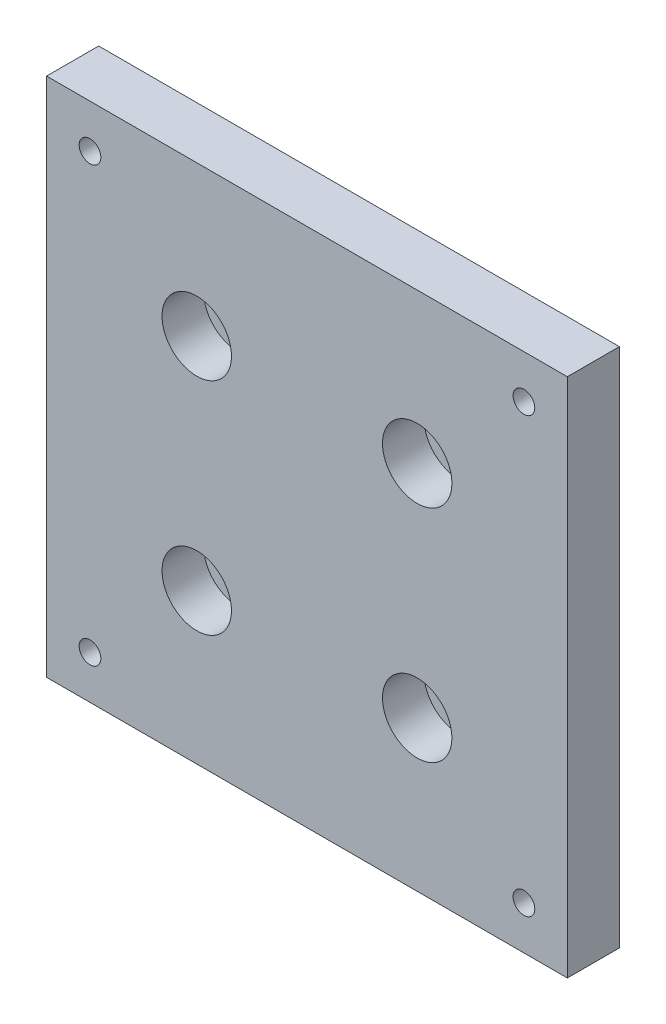
ISO-10303-21;
HEADER;
FILE_DESCRIPTION(('STEP AP214'),'2;1');
FILE_NAME('part.step','',(''),(''),'','','');
FILE_SCHEMA(('AUTOMOTIVE_DESIGN { 1 0 10303 214 1 1 1 1 }'));
ENDSEC;
DATA;
#1=APPLICATION_CONTEXT('core data for automotive mechanical design processes');
#2=APPLICATION_PROTOCOL_DEFINITION('international standard','automotive_design',2000,#1);
#3=PRODUCT_CONTEXT('',#1,'mechanical');
#4=PRODUCT('Part','Part','',(#3));
#5=PRODUCT_RELATED_PRODUCT_CATEGORY('part','',(#4));
#6=PRODUCT_DEFINITION_FORMATION('','',#4);
#7=PRODUCT_DEFINITION_CONTEXT('part definition',#1,'design');
#8=PRODUCT_DEFINITION('design','',#6,#7);
#9=PRODUCT_DEFINITION_SHAPE('','',#8);
#10=(LENGTH_UNIT() NAMED_UNIT(*) SI_UNIT(.MILLI.,.METRE.));
#11=(NAMED_UNIT(*) PLANE_ANGLE_UNIT() SI_UNIT($,.RADIAN.));
#12=(NAMED_UNIT(*) SI_UNIT($,.STERADIAN.) SOLID_ANGLE_UNIT());
#13=UNCERTAINTY_MEASURE_WITH_UNIT(LENGTH_MEASURE(1.E-05),#10,'distance_accuracy_value','');
#14=(GEOMETRIC_REPRESENTATION_CONTEXT(3) GLOBAL_UNCERTAINTY_ASSIGNED_CONTEXT((#13)) GLOBAL_UNIT_ASSIGNED_CONTEXT((#10,
#11,#12)) REPRESENTATION_CONTEXT('',''));
#15=CARTESIAN_POINT('',(0.,0.,0.));
#16=DIRECTION('',(0.,0.,1.));
#17=DIRECTION('',(1.,0.,0.));
#18=AXIS2_PLACEMENT_3D('',#15,#16,#17);
#19=CARTESIAN_POINT('',(30.,30.,6.));
#20=DIRECTION('',(-1.,0.,0.));
#21=DIRECTION('',(0.,0.,1.));
#22=AXIS2_PLACEMENT_3D('',#19,#20,#21);
#23=PLANE('',#22);
#24=DIRECTION('',(0.,1.,0.));
#25=VECTOR('',#24,1.);
#26=CARTESIAN_POINT('',(30.,30.,0.));
#27=LINE('',#26,#25);
#28=CARTESIAN_POINT('',(30.,-30.,0.));
#29=VERTEX_POINT('',#28);
#30=CARTESIAN_POINT('',(30.,30.,0.));
#31=VERTEX_POINT('',#30);
#32=EDGE_CURVE('E109',#29,#31,#27,.T.);
#33=ORIENTED_EDGE('',*,*,#32,.T.);
#34=DIRECTION('',(0.,0.,-1.));
#35=VECTOR('',#34,1.);
#36=CARTESIAN_POINT('',(30.,30.,6.));
#37=LINE('',#36,#35);
#38=CARTESIAN_POINT('',(30.,30.,6.));
#39=VERTEX_POINT('',#38);
#40=EDGE_CURVE('E11',#39,#31,#37,.T.);
#41=ORIENTED_EDGE('',*,*,#40,.F.);
#42=DIRECTION('',(0.,1.,0.));
#43=VECTOR('',#42,1.);
#44=CARTESIAN_POINT('',(30.,30.,6.));
#45=LINE('',#44,#43);
#46=CARTESIAN_POINT('',(30.,-30.,6.));
#47=VERTEX_POINT('',#46);
#48=EDGE_CURVE('E93',#47,#39,#45,.T.);
#49=ORIENTED_EDGE('',*,*,#48,.F.);
#50=DIRECTION('',(0.,0.,-1.));
#51=VECTOR('',#50,1.);
#52=CARTESIAN_POINT('',(30.,-30.,6.));
#53=LINE('',#52,#51);
#54=EDGE_CURVE('E105',#47,#29,#53,.T.);
#55=ORIENTED_EDGE('',*,*,#54,.T.);
#56=EDGE_LOOP('',(#33,#41,#49,#55));
#57=FACE_BOUND('',#56,.T.);
#58=ADVANCED_FACE('F41',(#57),#23,.F.);
#59=CARTESIAN_POINT('',(-30.,30.,6.));
#60=DIRECTION('',(0.,-1.,0.));
#61=DIRECTION('',(0.,0.,-1.));
#62=AXIS2_PLACEMENT_3D('',#59,#60,#61);
#63=PLANE('',#62);
#64=DIRECTION('',(-1.,0.,0.));
#65=VECTOR('',#64,1.);
#66=CARTESIAN_POINT('',(-30.,30.,0.));
#67=LINE('',#66,#65);
#68=CARTESIAN_POINT('',(-30.,30.,0.));
#69=VERTEX_POINT('',#68);
#70=EDGE_CURVE('E98',#31,#69,#67,.T.);
#71=ORIENTED_EDGE('',*,*,#70,.T.);
#72=DIRECTION('',(0.,0.,-1.));
#73=VECTOR('',#72,1.);
#74=CARTESIAN_POINT('',(-30.,30.,6.));
#75=LINE('',#74,#73);
#76=CARTESIAN_POINT('',(-30.,30.,6.));
#77=VERTEX_POINT('',#76);
#78=EDGE_CURVE('E50',#77,#69,#75,.T.);
#79=ORIENTED_EDGE('',*,*,#78,.F.);
#80=DIRECTION('',(-1.,0.,0.));
#81=VECTOR('',#80,1.);
#82=CARTESIAN_POINT('',(-30.,30.,6.));
#83=LINE('',#82,#81);
#84=EDGE_CURVE('E88',#39,#77,#83,.T.);
#85=ORIENTED_EDGE('',*,*,#84,.F.);
#86=ORIENTED_EDGE('',*,*,#40,.T.);
#87=EDGE_LOOP('',(#71,#79,#85,#86));
#88=FACE_BOUND('',#87,.T.);
#89=ADVANCED_FACE('F97',(#88),#63,.F.);
#90=CARTESIAN_POINT('',(-30.,30.,6.));
#91=DIRECTION('',(1.,0.,0.));
#92=DIRECTION('',(0.,1.,0.));
#93=AXIS2_PLACEMENT_3D('',#90,#91,#92);
#94=PLANE('',#93);
#95=DIRECTION('',(0.,-1.,0.));
#96=VECTOR('',#95,1.);
#97=CARTESIAN_POINT('',(-30.,30.,0.));
#98=LINE('',#97,#96);
#99=CARTESIAN_POINT('',(-30.,-30.,0.));
#100=VERTEX_POINT('',#99);
#101=EDGE_CURVE('E75',#69,#100,#98,.T.);
#102=ORIENTED_EDGE('',*,*,#101,.T.);
#103=DIRECTION('',(0.,0.,-1.));
#104=VECTOR('',#103,1.);
#105=CARTESIAN_POINT('',(-30.,-30.,6.));
#106=LINE('',#105,#104);
#107=CARTESIAN_POINT('',(-30.,-30.,6.));
#108=VERTEX_POINT('',#107);
#109=EDGE_CURVE('E100',#108,#100,#106,.T.);
#110=ORIENTED_EDGE('',*,*,#109,.F.);
#111=DIRECTION('',(0.,-1.,0.));
#112=VECTOR('',#111,1.);
#113=CARTESIAN_POINT('',(-30.,30.,6.));
#114=LINE('',#113,#112);
#115=EDGE_CURVE('E91',#77,#108,#114,.T.);
#116=ORIENTED_EDGE('',*,*,#115,.F.);
#117=ORIENTED_EDGE('',*,*,#78,.T.);
#118=EDGE_LOOP('',(#102,#110,#116,#117));
#119=FACE_BOUND('',#118,.T.);
#120=ADVANCED_FACE('F101',(#119),#94,.F.);
#121=CARTESIAN_POINT('',(-30.,-30.,6.));
#122=DIRECTION('',(0.,1.,0.));
#123=DIRECTION('',(0.,0.,1.));
#124=AXIS2_PLACEMENT_3D('',#121,#122,#123);
#125=PLANE('',#124);
#126=DIRECTION('',(1.,0.,0.));
#127=VECTOR('',#126,1.);
#128=CARTESIAN_POINT('',(-30.,-30.,0.));
#129=LINE('',#128,#127);
#130=EDGE_CURVE('E81',#100,#29,#129,.T.);
#131=ORIENTED_EDGE('',*,*,#130,.T.);
#132=ORIENTED_EDGE('',*,*,#54,.F.);
#133=DIRECTION('',(1.,0.,0.));
#134=VECTOR('',#133,1.);
#135=CARTESIAN_POINT('',(-30.,-30.,6.));
#136=LINE('',#135,#134);
#137=EDGE_CURVE('E58',#108,#47,#136,.T.);
#138=ORIENTED_EDGE('',*,*,#137,.F.);
#139=ORIENTED_EDGE('',*,*,#109,.T.);
#140=EDGE_LOOP('',(#131,#132,#138,#139));
#141=FACE_BOUND('',#140,.T.);
#142=ADVANCED_FACE('F123',(#141),#125,.F.);
#143=CARTESIAN_POINT('',(0.,0.,6.));
#144=DIRECTION('',(0.,0.,1.));
#145=DIRECTION('',(1.,0.,0.));
#146=AXIS2_PLACEMENT_3D('',#143,#144,#145);
#147=PLANE('',#146);
#148=CARTESIAN_POINT('',(-12.7,12.7,6.));
#149=DIRECTION('',(0.,0.,1.));
#150=DIRECTION('',(1.,0.,0.));
#151=AXIS2_PLACEMENT_3D('',#148,#149,#150);
#152=CIRCLE('',#151,4.00000000000001);
#153=CARTESIAN_POINT('',(-8.69999999999999,12.7,6.));
#154=VERTEX_POINT('',#153);
#155=EDGE_CURVE('E221',#154,#154,#152,.T.);
#156=ORIENTED_EDGE('',*,*,#155,.F.);
#157=EDGE_LOOP('',(#156));
#158=FACE_BOUND('',#157,.T.);
#159=CARTESIAN_POINT('',(12.7,12.7,6.));
#160=DIRECTION('',(0.,0.,1.));
#161=DIRECTION('',(1.,0.,0.));
#162=AXIS2_PLACEMENT_3D('',#159,#160,#161);
#163=CIRCLE('',#162,4.00000000000001);
#164=CARTESIAN_POINT('',(16.7,12.7,6.));
#165=VERTEX_POINT('',#164);
#166=EDGE_CURVE('E205',#165,#165,#163,.T.);
#167=ORIENTED_EDGE('',*,*,#166,.F.);
#168=EDGE_LOOP('',(#167));
#169=FACE_BOUND('',#168,.T.);
#170=CARTESIAN_POINT('',(12.7,-12.7,6.));
#171=DIRECTION('',(0.,0.,1.));
#172=DIRECTION('',(1.,0.,0.));
#173=AXIS2_PLACEMENT_3D('',#170,#171,#172);
#174=CIRCLE('',#173,4.00000000000001);
#175=CARTESIAN_POINT('',(16.7,-12.7,6.));
#176=VERTEX_POINT('',#175);
#177=EDGE_CURVE('E189',#176,#176,#174,.T.);
#178=ORIENTED_EDGE('',*,*,#177,.F.);
#179=EDGE_LOOP('',(#178));
#180=FACE_BOUND('',#179,.T.);
#181=CARTESIAN_POINT('',(-12.7,-12.7,6.));
#182=DIRECTION('',(0.,0.,1.));
#183=DIRECTION('',(1.,0.,0.));
#184=AXIS2_PLACEMENT_3D('',#181,#182,#183);
#185=CIRCLE('',#184,4.00000000000001);
#186=CARTESIAN_POINT('',(-8.69999999999999,-12.7,6.));
#187=VERTEX_POINT('',#186);
#188=EDGE_CURVE('E173',#187,#187,#185,.T.);
#189=ORIENTED_EDGE('',*,*,#188,.F.);
#190=EDGE_LOOP('',(#189));
#191=FACE_BOUND('',#190,.T.);
#192=CARTESIAN_POINT('',(-25.,25.,6.));
#193=DIRECTION('',(0.,0.,1.));
#194=DIRECTION('',(1.,0.,0.));
#195=AXIS2_PLACEMENT_3D('',#192,#193,#194);
#196=CIRCLE('',#195,1.24999999999999);
#197=CARTESIAN_POINT('',(-23.75,25.,6.));
#198=VERTEX_POINT('',#197);
#199=EDGE_CURVE('E157',#198,#198,#196,.T.);
#200=ORIENTED_EDGE('',*,*,#199,.F.);
#201=EDGE_LOOP('',(#200));
#202=FACE_BOUND('',#201,.T.);
#203=CARTESIAN_POINT('',(25.,25.,6.));
#204=DIRECTION('',(0.,0.,1.));
#205=DIRECTION('',(1.,0.,0.));
#206=AXIS2_PLACEMENT_3D('',#203,#204,#205);
#207=CIRCLE('',#206,1.24999999999999);
#208=CARTESIAN_POINT('',(26.25,25.,6.));
#209=VERTEX_POINT('',#208);
#210=EDGE_CURVE('E149',#209,#209,#207,.T.);
#211=ORIENTED_EDGE('',*,*,#210,.F.);
#212=EDGE_LOOP('',(#211));
#213=FACE_BOUND('',#212,.T.);
#214=CARTESIAN_POINT('',(25.,-25.,6.));
#215=DIRECTION('',(0.,0.,1.));
#216=DIRECTION('',(1.,0.,0.));
#217=AXIS2_PLACEMENT_3D('',#214,#215,#216);
#218=CIRCLE('',#217,1.24999999999999);
#219=CARTESIAN_POINT('',(26.25,-25.,6.));
#220=VERTEX_POINT('',#219);
#221=EDGE_CURVE('E141',#220,#220,#218,.T.);
#222=ORIENTED_EDGE('',*,*,#221,.F.);
#223=EDGE_LOOP('',(#222));
#224=FACE_BOUND('',#223,.T.);
#225=CARTESIAN_POINT('',(-25.,-25.,6.));
#226=DIRECTION('',(0.,0.,1.));
#227=DIRECTION('',(1.,0.,0.));
#228=AXIS2_PLACEMENT_3D('',#225,#226,#227);
#229=CIRCLE('',#228,1.24999999999999);
#230=CARTESIAN_POINT('',(-23.75,-25.,6.));
#231=VERTEX_POINT('',#230);
#232=EDGE_CURVE('E133',#231,#231,#229,.T.);
#233=ORIENTED_EDGE('',*,*,#232,.F.);
#234=EDGE_LOOP('',(#233));
#235=FACE_BOUND('',#234,.T.);
#236=ORIENTED_EDGE('',*,*,#48,.T.);
#237=ORIENTED_EDGE('',*,*,#84,.T.);
#238=ORIENTED_EDGE('',*,*,#115,.T.);
#239=ORIENTED_EDGE('',*,*,#137,.T.);
#240=EDGE_LOOP('',(#236,#237,#238,#239));
#241=FACE_BOUND('',#240,.T.);
#242=ADVANCED_FACE('F89',(#158,#169,#180,#191,#202,#213,#224,#235,#241),#147,.T.);
#243=CARTESIAN_POINT('',(0.,0.,0.));
#244=DIRECTION('',(0.,0.,1.));
#245=DIRECTION('',(1.,0.,0.));
#246=AXIS2_PLACEMENT_3D('',#243,#244,#245);
#247=PLANE('',#246);
#248=CARTESIAN_POINT('',(-12.7,12.7,0.));
#249=DIRECTION('',(0.,0.,1.));
#250=DIRECTION('',(1.,0.,0.));
#251=AXIS2_PLACEMENT_3D('',#248,#249,#250);
#252=CIRCLE('',#251,2.00000000000001);
#253=CARTESIAN_POINT('',(-10.7,12.7,0.));
#254=VERTEX_POINT('',#253);
#255=EDGE_CURVE('E209',#254,#254,#252,.T.);
#256=ORIENTED_EDGE('',*,*,#255,.T.);
#257=EDGE_LOOP('',(#256));
#258=FACE_BOUND('',#257,.T.);
#259=CARTESIAN_POINT('',(12.7,12.7,0.));
#260=DIRECTION('',(0.,0.,1.));
#261=DIRECTION('',(1.,0.,0.));
#262=AXIS2_PLACEMENT_3D('',#259,#260,#261);
#263=CIRCLE('',#262,2.00000000000001);
#264=CARTESIAN_POINT('',(14.7,12.7,0.));
#265=VERTEX_POINT('',#264);
#266=EDGE_CURVE('E193',#265,#265,#263,.T.);
#267=ORIENTED_EDGE('',*,*,#266,.T.);
#268=EDGE_LOOP('',(#267));
#269=FACE_BOUND('',#268,.T.);
#270=CARTESIAN_POINT('',(12.7,-12.7,0.));
#271=DIRECTION('',(0.,0.,1.));
#272=DIRECTION('',(1.,0.,0.));
#273=AXIS2_PLACEMENT_3D('',#270,#271,#272);
#274=CIRCLE('',#273,2.00000000000001);
#275=CARTESIAN_POINT('',(14.7,-12.7,0.));
#276=VERTEX_POINT('',#275);
#277=EDGE_CURVE('E177',#276,#276,#274,.T.);
#278=ORIENTED_EDGE('',*,*,#277,.T.);
#279=EDGE_LOOP('',(#278));
#280=FACE_BOUND('',#279,.T.);
#281=CARTESIAN_POINT('',(-12.7,-12.7,0.));
#282=DIRECTION('',(0.,0.,1.));
#283=DIRECTION('',(1.,0.,0.));
#284=AXIS2_PLACEMENT_3D('',#281,#282,#283);
#285=CIRCLE('',#284,2.00000000000001);
#286=CARTESIAN_POINT('',(-10.7,-12.7,0.));
#287=VERTEX_POINT('',#286);
#288=EDGE_CURVE('E161',#287,#287,#285,.T.);
#289=ORIENTED_EDGE('',*,*,#288,.T.);
#290=EDGE_LOOP('',(#289));
#291=FACE_BOUND('',#290,.T.);
#292=CARTESIAN_POINT('',(-25.,25.,0.));
#293=DIRECTION('',(0.,0.,1.));
#294=DIRECTION('',(1.,0.,0.));
#295=AXIS2_PLACEMENT_3D('',#292,#293,#294);
#296=CIRCLE('',#295,1.25);
#297=CARTESIAN_POINT('',(-23.75,25.,0.));
#298=VERTEX_POINT('',#297);
#299=EDGE_CURVE('E153',#298,#298,#296,.T.);
#300=ORIENTED_EDGE('',*,*,#299,.T.);
#301=EDGE_LOOP('',(#300));
#302=FACE_BOUND('',#301,.T.);
#303=CARTESIAN_POINT('',(25.,25.,0.));
#304=DIRECTION('',(0.,0.,1.));
#305=DIRECTION('',(1.,0.,0.));
#306=AXIS2_PLACEMENT_3D('',#303,#304,#305);
#307=CIRCLE('',#306,1.25);
#308=CARTESIAN_POINT('',(26.25,25.,0.));
#309=VERTEX_POINT('',#308);
#310=EDGE_CURVE('E145',#309,#309,#307,.T.);
#311=ORIENTED_EDGE('',*,*,#310,.T.);
#312=EDGE_LOOP('',(#311));
#313=FACE_BOUND('',#312,.T.);
#314=CARTESIAN_POINT('',(25.,-25.,0.));
#315=DIRECTION('',(0.,0.,1.));
#316=DIRECTION('',(1.,0.,0.));
#317=AXIS2_PLACEMENT_3D('',#314,#315,#316);
#318=CIRCLE('',#317,1.25);
#319=CARTESIAN_POINT('',(26.25,-25.,0.));
#320=VERTEX_POINT('',#319);
#321=EDGE_CURVE('E137',#320,#320,#318,.T.);
#322=ORIENTED_EDGE('',*,*,#321,.T.);
#323=EDGE_LOOP('',(#322));
#324=FACE_BOUND('',#323,.T.);
#325=CARTESIAN_POINT('',(-25.,-25.,0.));
#326=DIRECTION('',(0.,0.,1.));
#327=DIRECTION('',(1.,0.,0.));
#328=AXIS2_PLACEMENT_3D('',#325,#326,#327);
#329=CIRCLE('',#328,1.25);
#330=CARTESIAN_POINT('',(-23.75,-25.,0.));
#331=VERTEX_POINT('',#330);
#332=EDGE_CURVE('E113',#331,#331,#329,.T.);
#333=ORIENTED_EDGE('',*,*,#332,.T.);
#334=EDGE_LOOP('',(#333));
#335=FACE_BOUND('',#334,.T.);
#336=ORIENTED_EDGE('',*,*,#32,.F.);
#337=ORIENTED_EDGE('',*,*,#130,.F.);
#338=ORIENTED_EDGE('',*,*,#101,.F.);
#339=ORIENTED_EDGE('',*,*,#70,.F.);
#340=EDGE_LOOP('',(#336,#337,#338,#339));
#341=FACE_BOUND('',#340,.T.);
#342=ADVANCED_FACE('F126',(#258,#269,#280,#291,#302,#313,#324,#335,#341),#247,.F.);
#343=CARTESIAN_POINT('',(-25.,-25.,6.));
#344=DIRECTION('',(0.,0.,1.));
#345=DIRECTION('',(1.,0.,0.));
#346=AXIS2_PLACEMENT_3D('',#343,#344,#345);
#347=CYLINDRICAL_SURFACE('',#346,1.24999999999999);
#348=ORIENTED_EDGE('',*,*,#332,.F.);
#349=EDGE_LOOP('',(#348));
#350=FACE_BOUND('',#349,.T.);
#351=ORIENTED_EDGE('',*,*,#232,.T.);
#352=EDGE_LOOP('',(#351));
#353=FACE_BOUND('',#352,.T.);
#354=ADVANCED_FACE('F245',(#350,#353),#347,.F.);
#355=CARTESIAN_POINT('',(25.,-25.,6.));
#356=DIRECTION('',(0.,0.,1.));
#357=DIRECTION('',(1.,0.,0.));
#358=AXIS2_PLACEMENT_3D('',#355,#356,#357);
#359=CYLINDRICAL_SURFACE('',#358,1.24999999999999);
#360=ORIENTED_EDGE('',*,*,#321,.F.);
#361=EDGE_LOOP('',(#360));
#362=FACE_BOUND('',#361,.T.);
#363=ORIENTED_EDGE('',*,*,#221,.T.);
#364=EDGE_LOOP('',(#363));
#365=FACE_BOUND('',#364,.T.);
#366=ADVANCED_FACE('F247',(#362,#365),#359,.F.);
#367=CARTESIAN_POINT('',(25.,25.,6.));
#368=DIRECTION('',(0.,0.,1.));
#369=DIRECTION('',(1.,0.,0.));
#370=AXIS2_PLACEMENT_3D('',#367,#368,#369);
#371=CYLINDRICAL_SURFACE('',#370,1.24999999999999);
#372=ORIENTED_EDGE('',*,*,#310,.F.);
#373=EDGE_LOOP('',(#372));
#374=FACE_BOUND('',#373,.T.);
#375=ORIENTED_EDGE('',*,*,#210,.T.);
#376=EDGE_LOOP('',(#375));
#377=FACE_BOUND('',#376,.T.);
#378=ADVANCED_FACE('F254',(#374,#377),#371,.F.);
#379=CARTESIAN_POINT('',(-25.,25.,6.));
#380=DIRECTION('',(0.,0.,1.));
#381=DIRECTION('',(1.,0.,0.));
#382=AXIS2_PLACEMENT_3D('',#379,#380,#381);
#383=CYLINDRICAL_SURFACE('',#382,1.24999999999999);
#384=ORIENTED_EDGE('',*,*,#299,.F.);
#385=EDGE_LOOP('',(#384));
#386=FACE_BOUND('',#385,.T.);
#387=ORIENTED_EDGE('',*,*,#199,.T.);
#388=EDGE_LOOP('',(#387));
#389=FACE_BOUND('',#388,.T.);
#390=ADVANCED_FACE('F296',(#386,#389),#383,.F.);
#391=CARTESIAN_POINT('',(-12.7,-12.7,6.));
#392=DIRECTION('',(0.,0.,1.));
#393=DIRECTION('',(1.,0.,0.));
#394=AXIS2_PLACEMENT_3D('',#391,#392,#393);
#395=CYLINDRICAL_SURFACE('',#394,2.00000000000001);
#396=ORIENTED_EDGE('',*,*,#288,.F.);
#397=EDGE_LOOP('',(#396));
#398=FACE_BOUND('',#397,.T.);
#399=CARTESIAN_POINT('',(-12.7,-12.7,1.2));
#400=DIRECTION('',(0.,0.,1.));
#401=DIRECTION('',(1.,0.,0.));
#402=AXIS2_PLACEMENT_3D('',#399,#400,#401);
#403=CIRCLE('',#402,2.00000000000001);
#404=CARTESIAN_POINT('',(-10.7,-12.7,1.2));
#405=VERTEX_POINT('',#404);
#406=EDGE_CURVE('E165',#405,#405,#403,.T.);
#407=ORIENTED_EDGE('',*,*,#406,.T.);
#408=EDGE_LOOP('',(#407));
#409=FACE_BOUND('',#408,.T.);
#410=ADVANCED_FACE('F290',(#398,#409),#395,.F.);
#411=CARTESIAN_POINT('',(-10.7,-12.7,1.2));
#412=DIRECTION('',(0.,0.,-1.));
#413=DIRECTION('',(-1.,0.,0.));
#414=AXIS2_PLACEMENT_3D('',#411,#412,#413);
#415=PLANE('',#414);
#416=ORIENTED_EDGE('',*,*,#406,.F.);
#417=EDGE_LOOP('',(#416));
#418=FACE_BOUND('',#417,.T.);
#419=CARTESIAN_POINT('',(-12.7,-12.7,1.2));
#420=DIRECTION('',(0.,0.,1.));
#421=DIRECTION('',(1.,0.,0.));
#422=AXIS2_PLACEMENT_3D('',#419,#420,#421);
#423=CIRCLE('',#422,4.00000000000001);
#424=CARTESIAN_POINT('',(-8.69999999999999,-12.7,1.2));
#425=VERTEX_POINT('',#424);
#426=EDGE_CURVE('E169',#425,#425,#423,.T.);
#427=ORIENTED_EDGE('',*,*,#426,.T.);
#428=EDGE_LOOP('',(#427));
#429=FACE_BOUND('',#428,.T.);
#430=ADVANCED_FACE('F295',(#418,#429),#415,.F.);
#431=CARTESIAN_POINT('',(-12.7,-12.7,6.));
#432=DIRECTION('',(0.,0.,1.));
#433=DIRECTION('',(1.,0.,0.));
#434=AXIS2_PLACEMENT_3D('',#431,#432,#433);
#435=CYLINDRICAL_SURFACE('',#434,4.00000000000001);
#436=ORIENTED_EDGE('',*,*,#426,.F.);
#437=EDGE_LOOP('',(#436));
#438=FACE_BOUND('',#437,.T.);
#439=ORIENTED_EDGE('',*,*,#188,.T.);
#440=EDGE_LOOP('',(#439));
#441=FACE_BOUND('',#440,.T.);
#442=ADVANCED_FACE('F308',(#438,#441),#435,.F.);
#443=CARTESIAN_POINT('',(12.7,-12.7,6.));
#444=DIRECTION('',(0.,0.,1.));
#445=DIRECTION('',(1.,0.,0.));
#446=AXIS2_PLACEMENT_3D('',#443,#444,#445);
#447=CYLINDRICAL_SURFACE('',#446,2.00000000000001);
#448=ORIENTED_EDGE('',*,*,#277,.F.);
#449=EDGE_LOOP('',(#448));
#450=FACE_BOUND('',#449,.T.);
#451=CARTESIAN_POINT('',(12.7,-12.7,1.2));
#452=DIRECTION('',(0.,0.,1.));
#453=DIRECTION('',(1.,0.,0.));
#454=AXIS2_PLACEMENT_3D('',#451,#452,#453);
#455=CIRCLE('',#454,2.00000000000001);
#456=CARTESIAN_POINT('',(14.7,-12.7,1.2));
#457=VERTEX_POINT('',#456);
#458=EDGE_CURVE('E181',#457,#457,#455,.T.);
#459=ORIENTED_EDGE('',*,*,#458,.T.);
#460=EDGE_LOOP('',(#459));
#461=FACE_BOUND('',#460,.T.);
#462=ADVANCED_FACE('F318',(#450,#461),#447,.F.);
#463=CARTESIAN_POINT('',(14.7,-12.7,1.2));
#464=DIRECTION('',(0.,0.,-1.));
#465=DIRECTION('',(-1.,0.,0.));
#466=AXIS2_PLACEMENT_3D('',#463,#464,#465);
#467=PLANE('',#466);
#468=ORIENTED_EDGE('',*,*,#458,.F.);
#469=EDGE_LOOP('',(#468));
#470=FACE_BOUND('',#469,.T.);
#471=CARTESIAN_POINT('',(12.7,-12.7,1.2));
#472=DIRECTION('',(0.,0.,1.));
#473=DIRECTION('',(1.,0.,0.));
#474=AXIS2_PLACEMENT_3D('',#471,#472,#473);
#475=CIRCLE('',#474,4.00000000000001);
#476=CARTESIAN_POINT('',(16.7,-12.7,1.2));
#477=VERTEX_POINT('',#476);
#478=EDGE_CURVE('E185',#477,#477,#475,.T.);
#479=ORIENTED_EDGE('',*,*,#478,.T.);
#480=EDGE_LOOP('',(#479));
#481=FACE_BOUND('',#480,.T.);
#482=ADVANCED_FACE('F328',(#470,#481),#467,.F.);
#483=CARTESIAN_POINT('',(12.7,-12.7,6.));
#484=DIRECTION('',(0.,0.,1.));
#485=DIRECTION('',(1.,0.,0.));
#486=AXIS2_PLACEMENT_3D('',#483,#484,#485);
#487=CYLINDRICAL_SURFACE('',#486,4.00000000000001);
#488=ORIENTED_EDGE('',*,*,#478,.F.);
#489=EDGE_LOOP('',(#488));
#490=FACE_BOUND('',#489,.T.);
#491=ORIENTED_EDGE('',*,*,#177,.T.);
#492=EDGE_LOOP('',(#491));
#493=FACE_BOUND('',#492,.T.);
#494=ADVANCED_FACE('F338',(#490,#493),#487,.F.);
#495=CARTESIAN_POINT('',(12.7,12.7,6.));
#496=DIRECTION('',(0.,0.,1.));
#497=DIRECTION('',(1.,0.,0.));
#498=AXIS2_PLACEMENT_3D('',#495,#496,#497);
#499=CYLINDRICAL_SURFACE('',#498,2.00000000000001);
#500=ORIENTED_EDGE('',*,*,#266,.F.);
#501=EDGE_LOOP('',(#500));
#502=FACE_BOUND('',#501,.T.);
#503=CARTESIAN_POINT('',(12.7,12.7,1.2));
#504=DIRECTION('',(0.,0.,1.));
#505=DIRECTION('',(1.,0.,0.));
#506=AXIS2_PLACEMENT_3D('',#503,#504,#505);
#507=CIRCLE('',#506,2.00000000000001);
#508=CARTESIAN_POINT('',(14.7,12.7,1.2));
#509=VERTEX_POINT('',#508);
#510=EDGE_CURVE('E197',#509,#509,#507,.T.);
#511=ORIENTED_EDGE('',*,*,#510,.T.);
#512=EDGE_LOOP('',(#511));
#513=FACE_BOUND('',#512,.T.);
#514=ADVANCED_FACE('F348',(#502,#513),#499,.F.);
#515=CARTESIAN_POINT('',(14.7,12.7,1.2));
#516=DIRECTION('',(0.,0.,-1.));
#517=DIRECTION('',(-1.,0.,0.));
#518=AXIS2_PLACEMENT_3D('',#515,#516,#517);
#519=PLANE('',#518);
#520=ORIENTED_EDGE('',*,*,#510,.F.);
#521=EDGE_LOOP('',(#520));
#522=FACE_BOUND('',#521,.T.);
#523=CARTESIAN_POINT('',(12.7,12.7,1.2));
#524=DIRECTION('',(0.,0.,1.));
#525=DIRECTION('',(1.,0.,0.));
#526=AXIS2_PLACEMENT_3D('',#523,#524,#525);
#527=CIRCLE('',#526,4.00000000000001);
#528=CARTESIAN_POINT('',(16.7,12.7,1.2));
#529=VERTEX_POINT('',#528);
#530=EDGE_CURVE('E201',#529,#529,#527,.T.);
#531=ORIENTED_EDGE('',*,*,#530,.T.);
#532=EDGE_LOOP('',(#531));
#533=FACE_BOUND('',#532,.T.);
#534=ADVANCED_FACE('F358',(#522,#533),#519,.F.);
#535=CARTESIAN_POINT('',(12.7,12.7,6.));
#536=DIRECTION('',(0.,0.,1.));
#537=DIRECTION('',(1.,0.,0.));
#538=AXIS2_PLACEMENT_3D('',#535,#536,#537);
#539=CYLINDRICAL_SURFACE('',#538,4.00000000000001);
#540=ORIENTED_EDGE('',*,*,#530,.F.);
#541=EDGE_LOOP('',(#540));
#542=FACE_BOUND('',#541,.T.);
#543=ORIENTED_EDGE('',*,*,#166,.T.);
#544=EDGE_LOOP('',(#543));
#545=FACE_BOUND('',#544,.T.);
#546=ADVANCED_FACE('F368',(#542,#545),#539,.F.);
#547=CARTESIAN_POINT('',(-12.7,12.7,6.));
#548=DIRECTION('',(0.,0.,1.));
#549=DIRECTION('',(1.,0.,0.));
#550=AXIS2_PLACEMENT_3D('',#547,#548,#549);
#551=CYLINDRICAL_SURFACE('',#550,2.00000000000001);
#552=ORIENTED_EDGE('',*,*,#255,.F.);
#553=EDGE_LOOP('',(#552));
#554=FACE_BOUND('',#553,.T.);
#555=CARTESIAN_POINT('',(-12.7,12.7,1.2));
#556=DIRECTION('',(0.,0.,1.));
#557=DIRECTION('',(1.,0.,0.));
#558=AXIS2_PLACEMENT_3D('',#555,#556,#557);
#559=CIRCLE('',#558,2.00000000000001);
#560=CARTESIAN_POINT('',(-10.7,12.7,1.2));
#561=VERTEX_POINT('',#560);
#562=EDGE_CURVE('E213',#561,#561,#559,.T.);
#563=ORIENTED_EDGE('',*,*,#562,.T.);
#564=EDGE_LOOP('',(#563));
#565=FACE_BOUND('',#564,.T.);
#566=ADVANCED_FACE('F378',(#554,#565),#551,.F.);
#567=CARTESIAN_POINT('',(-10.7,12.7,1.2));
#568=DIRECTION('',(0.,0.,-1.));
#569=DIRECTION('',(-1.,0.,0.));
#570=AXIS2_PLACEMENT_3D('',#567,#568,#569);
#571=PLANE('',#570);
#572=ORIENTED_EDGE('',*,*,#562,.F.);
#573=EDGE_LOOP('',(#572));
#574=FACE_BOUND('',#573,.T.);
#575=CARTESIAN_POINT('',(-12.7,12.7,1.2));
#576=DIRECTION('',(0.,0.,1.));
#577=DIRECTION('',(1.,0.,0.));
#578=AXIS2_PLACEMENT_3D('',#575,#576,#577);
#579=CIRCLE('',#578,4.00000000000001);
#580=CARTESIAN_POINT('',(-8.69999999999999,12.7,1.2));
#581=VERTEX_POINT('',#580);
#582=EDGE_CURVE('E217',#581,#581,#579,.T.);
#583=ORIENTED_EDGE('',*,*,#582,.T.);
#584=EDGE_LOOP('',(#583));
#585=FACE_BOUND('',#584,.T.);
#586=ADVANCED_FACE('F388',(#574,#585),#571,.F.);
#587=CARTESIAN_POINT('',(-12.7,12.7,6.));
#588=DIRECTION('',(0.,0.,1.));
#589=DIRECTION('',(1.,0.,0.));
#590=AXIS2_PLACEMENT_3D('',#587,#588,#589);
#591=CYLINDRICAL_SURFACE('',#590,4.00000000000001);
#592=ORIENTED_EDGE('',*,*,#582,.F.);
#593=EDGE_LOOP('',(#592));
#594=FACE_BOUND('',#593,.T.);
#595=ORIENTED_EDGE('',*,*,#155,.T.);
#596=EDGE_LOOP('',(#595));
#597=FACE_BOUND('',#596,.T.);
#598=ADVANCED_FACE('F226',(#594,#597),#591,.F.);
#599=CLOSED_SHELL('',(#58,#89,#120,#142,#242,#342,#354,#366,#378,#390,#410,#430,#442,#462,#482,
#494,#514,#534,#546,#566,#586,#598));
#600=MANIFOLD_SOLID_BREP('B2',#599);
#601=ADVANCED_BREP_SHAPE_REPRESENTATION('',(#18,#600),#14);
#602=SHAPE_DEFINITION_REPRESENTATION(#9,#601);
ENDSEC;
END-ISO-10303-21;
